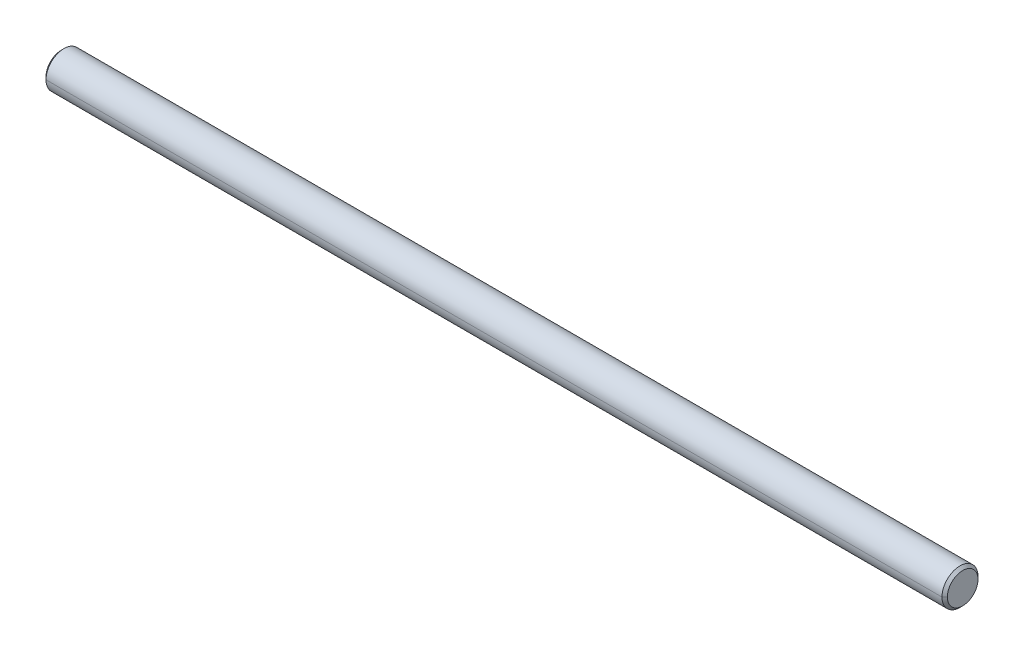
ISO-10303-21;
HEADER;
FILE_DESCRIPTION(('STEP AP214'),'2;1');
FILE_NAME('part.step','',(''),(''),'','','');
FILE_SCHEMA(('AUTOMOTIVE_DESIGN { 1 0 10303 214 1 1 1 1 }'));
ENDSEC;
DATA;
#1=APPLICATION_CONTEXT('core data for automotive mechanical design processes');
#2=APPLICATION_PROTOCOL_DEFINITION('international standard','automotive_design',2000,#1);
#3=PRODUCT_CONTEXT('',#1,'mechanical');
#4=PRODUCT('Part','Part','',(#3));
#5=PRODUCT_RELATED_PRODUCT_CATEGORY('part','',(#4));
#6=PRODUCT_DEFINITION_FORMATION('','',#4);
#7=PRODUCT_DEFINITION_CONTEXT('part definition',#1,'design');
#8=PRODUCT_DEFINITION('design','',#6,#7);
#9=PRODUCT_DEFINITION_SHAPE('','',#8);
#10=(LENGTH_UNIT() NAMED_UNIT(*) SI_UNIT(.MILLI.,.METRE.));
#11=(NAMED_UNIT(*) PLANE_ANGLE_UNIT() SI_UNIT($,.RADIAN.));
#12=(NAMED_UNIT(*) SI_UNIT($,.STERADIAN.) SOLID_ANGLE_UNIT());
#13=UNCERTAINTY_MEASURE_WITH_UNIT(LENGTH_MEASURE(1.E-05),#10,'distance_accuracy_value','');
#14=(GEOMETRIC_REPRESENTATION_CONTEXT(3) GLOBAL_UNCERTAINTY_ASSIGNED_CONTEXT((#13)) GLOBAL_UNIT_ASSIGNED_CONTEXT((#10,
#11,#12)) REPRESENTATION_CONTEXT('',''));
#15=CARTESIAN_POINT('',(0.,0.,0.));
#16=DIRECTION('',(0.,0.,1.));
#17=DIRECTION('',(1.,0.,0.));
#18=AXIS2_PLACEMENT_3D('',#15,#16,#17);
#19=CARTESIAN_POINT('',(248.5,0.,0.));
#20=DIRECTION('',(-1.,0.,0.));
#21=DIRECTION('',(0.,-1.,0.));
#22=AXIS2_PLACEMENT_3D('',#19,#20,#21);
#23=CONICAL_SURFACE('',#22,10.,0.7853981634);
#24=CARTESIAN_POINT('',(250.,0.,0.));
#25=DIRECTION('',(1.,0.,0.));
#26=DIRECTION('',(0.,0.,-1.));
#27=AXIS2_PLACEMENT_3D('',#24,#25,#26);
#28=CIRCLE('',#27,8.5);
#29=CARTESIAN_POINT('',(250.,0.,-8.5));
#30=VERTEX_POINT('',#29);
#31=CARTESIAN_POINT('',(249.999999999996,0.,8.49999999999617));
#32=VERTEX_POINT('',#31);
#33=EDGE_CURVE('E11',#30,#32,#28,.T.);
#34=ORIENTED_EDGE('',*,*,#33,.F.);
#35=DIRECTION('',(-0.707106781184734,0.,-0.707106781188361));
#36=VECTOR('',#35,1.);
#37=CARTESIAN_POINT('',(249.999999999996,0.,-8.49999999999617));
#38=LINE('',#37,#36);
#39=CARTESIAN_POINT('',(248.5,0.,-10.));
#40=VERTEX_POINT('',#39);
#41=EDGE_CURVE('E24',#30,#40,#38,.T.);
#42=ORIENTED_EDGE('',*,*,#41,.T.);
#43=CARTESIAN_POINT('',(248.5,0.,0.));
#44=DIRECTION('',(1.,0.,0.));
#45=DIRECTION('',(0.,0.,-1.));
#46=AXIS2_PLACEMENT_3D('',#43,#44,#45);
#47=CIRCLE('',#46,10.);
#48=CARTESIAN_POINT('',(248.5,0.,10.));
#49=VERTEX_POINT('',#48);
#50=EDGE_CURVE('E124',#40,#49,#47,.T.);
#51=ORIENTED_EDGE('',*,*,#50,.T.);
#52=DIRECTION('',(-0.707106781184734,0.,0.707106781188361));
#53=VECTOR('',#52,1.);
#54=CARTESIAN_POINT('',(249.999999999996,0.,8.49999999999617));
#55=LINE('',#54,#53);
#56=EDGE_CURVE('E119',#32,#49,#55,.T.);
#57=ORIENTED_EDGE('',*,*,#56,.F.);
#58=EDGE_LOOP('',(#34,#42,#51,#57));
#59=FACE_BOUND('',#58,.T.);
#60=ADVANCED_FACE('F16',(#59),#23,.T.);
#61=CARTESIAN_POINT('',(248.5,0.,0.));
#62=DIRECTION('',(-1.,0.,0.));
#63=DIRECTION('',(0.,1.,0.));
#64=AXIS2_PLACEMENT_3D('',#61,#62,#63);
#65=CONICAL_SURFACE('',#64,10.,0.7853981634);
#66=CARTESIAN_POINT('',(248.5,0.,0.));
#67=DIRECTION('',(1.,0.,0.));
#68=DIRECTION('',(0.,0.,-1.));
#69=AXIS2_PLACEMENT_3D('',#66,#67,#68);
#70=CIRCLE('',#69,10.);
#71=EDGE_CURVE('E115',#49,#40,#70,.T.);
#72=ORIENTED_EDGE('',*,*,#71,.T.);
#73=ORIENTED_EDGE('',*,*,#41,.F.);
#74=CARTESIAN_POINT('',(250.,0.,0.));
#75=DIRECTION('',(1.,0.,0.));
#76=DIRECTION('',(0.,0.,-1.));
#77=AXIS2_PLACEMENT_3D('',#74,#75,#76);
#78=CIRCLE('',#77,8.5);
#79=EDGE_CURVE('E110',#32,#30,#78,.T.);
#80=ORIENTED_EDGE('',*,*,#79,.F.);
#81=ORIENTED_EDGE('',*,*,#56,.T.);
#82=EDGE_LOOP('',(#72,#73,#80,#81));
#83=FACE_BOUND('',#82,.T.);
#84=ADVANCED_FACE('F138',(#83),#65,.T.);
#85=CARTESIAN_POINT('',(250.,8.5,0.));
#86=DIRECTION('',(-1.,0.,0.));
#87=DIRECTION('',(0.,0.,1.));
#88=AXIS2_PLACEMENT_3D('',#85,#86,#87);
#89=PLANE('',#88);
#90=ORIENTED_EDGE('',*,*,#33,.T.);
#91=ORIENTED_EDGE('',*,*,#79,.T.);
#92=EDGE_LOOP('',(#90,#91));
#93=FACE_BOUND('',#92,.T.);
#94=ADVANCED_FACE('F151',(#93),#89,.F.);
#95=CARTESIAN_POINT('',(-125.,0.,0.));
#96=DIRECTION('',(-1.,0.,0.));
#97=DIRECTION('',(0.,1.,0.));
#98=AXIS2_PLACEMENT_3D('',#95,#96,#97);
#99=CYLINDRICAL_SURFACE('',#98,10.);
#100=CARTESIAN_POINT('',(-248.5,0.,0.));
#101=DIRECTION('',(1.,0.,0.));
#102=DIRECTION('',(0.,0.,-1.));
#103=AXIS2_PLACEMENT_3D('',#100,#101,#102);
#104=CIRCLE('',#103,10.);
#105=CARTESIAN_POINT('',(-248.5,0.,10.));
#106=VERTEX_POINT('',#105);
#107=CARTESIAN_POINT('',(-248.5,0.,-10.));
#108=VERTEX_POINT('',#107);
#109=EDGE_CURVE('E73',#106,#108,#104,.T.);
#110=ORIENTED_EDGE('',*,*,#109,.T.);
#111=DIRECTION('',(-1.,0.,0.));
#112=VECTOR('',#111,1.);
#113=CARTESIAN_POINT('',(248.5,0.,-10.));
#114=LINE('',#113,#112);
#115=EDGE_CURVE('E101',#40,#108,#114,.T.);
#116=ORIENTED_EDGE('',*,*,#115,.F.);
#117=ORIENTED_EDGE('',*,*,#71,.F.);
#118=DIRECTION('',(-1.,0.,0.));
#119=VECTOR('',#118,1.);
#120=CARTESIAN_POINT('',(248.5,0.,10.));
#121=LINE('',#120,#119);
#122=EDGE_CURVE('E96',#49,#106,#121,.T.);
#123=ORIENTED_EDGE('',*,*,#122,.T.);
#124=EDGE_LOOP('',(#110,#116,#117,#123));
#125=FACE_BOUND('',#124,.T.);
#126=ADVANCED_FACE('F141',(#125),#99,.T.);
#127=CARTESIAN_POINT('',(-125.,0.,0.));
#128=DIRECTION('',(-1.,0.,0.));
#129=DIRECTION('',(0.,-1.,0.));
#130=AXIS2_PLACEMENT_3D('',#127,#128,#129);
#131=CYLINDRICAL_SURFACE('',#130,10.);
#132=ORIENTED_EDGE('',*,*,#50,.F.);
#133=ORIENTED_EDGE('',*,*,#115,.T.);
#134=CARTESIAN_POINT('',(-248.5,0.,0.));
#135=DIRECTION('',(1.,0.,0.));
#136=DIRECTION('',(0.,0.,-1.));
#137=AXIS2_PLACEMENT_3D('',#134,#135,#136);
#138=CIRCLE('',#137,10.);
#139=EDGE_CURVE('E91',#108,#106,#138,.T.);
#140=ORIENTED_EDGE('',*,*,#139,.T.);
#141=ORIENTED_EDGE('',*,*,#122,.F.);
#142=EDGE_LOOP('',(#132,#133,#140,#141));
#143=FACE_BOUND('',#142,.T.);
#144=ADVANCED_FACE('F142',(#143),#131,.T.);
#145=CARTESIAN_POINT('',(-250.,0.,0.));
#146=DIRECTION('',(1.,0.,0.));
#147=DIRECTION('',(0.,-1.,0.));
#148=AXIS2_PLACEMENT_3D('',#145,#146,#147);
#149=CONICAL_SURFACE('',#148,8.5,0.7853981634);
#150=ORIENTED_EDGE('',*,*,#139,.F.);
#151=DIRECTION('',(0.707106781184734,0.,-0.707106781188361));
#152=VECTOR('',#151,1.);
#153=CARTESIAN_POINT('',(-250.,0.,-8.5));
#154=LINE('',#153,#152);
#155=CARTESIAN_POINT('',(-250.,0.,-8.5));
#156=VERTEX_POINT('',#155);
#157=EDGE_CURVE('E64',#156,#108,#154,.T.);
#158=ORIENTED_EDGE('',*,*,#157,.F.);
#159=CARTESIAN_POINT('',(-250.,0.,0.));
#160=DIRECTION('',(1.,0.,0.));
#161=DIRECTION('',(0.,0.,-1.));
#162=AXIS2_PLACEMENT_3D('',#159,#160,#161);
#163=CIRCLE('',#162,8.5);
#164=CARTESIAN_POINT('',(-250.,0.,8.5));
#165=VERTEX_POINT('',#164);
#166=EDGE_CURVE('E57',#156,#165,#163,.T.);
#167=ORIENTED_EDGE('',*,*,#166,.T.);
#168=DIRECTION('',(0.707106781184734,0.,0.707106781188361));
#169=VECTOR('',#168,1.);
#170=CARTESIAN_POINT('',(-250.,0.,8.5));
#171=LINE('',#170,#169);
#172=EDGE_CURVE('E61',#165,#106,#171,.T.);
#173=ORIENTED_EDGE('',*,*,#172,.T.);
#174=EDGE_LOOP('',(#150,#158,#167,#173));
#175=FACE_BOUND('',#174,.T.);
#176=ADVANCED_FACE('F60',(#175),#149,.T.);
#177=CARTESIAN_POINT('',(-250.,0.,0.));
#178=DIRECTION('',(1.,0.,0.));
#179=DIRECTION('',(0.,1.,0.));
#180=AXIS2_PLACEMENT_3D('',#177,#178,#179);
#181=CONICAL_SURFACE('',#180,8.5,0.7853981634);
#182=CARTESIAN_POINT('',(-250.,0.,0.));
#183=DIRECTION('',(1.,0.,0.));
#184=DIRECTION('',(0.,0.,-1.));
#185=AXIS2_PLACEMENT_3D('',#182,#183,#184);
#186=CIRCLE('',#185,8.5);
#187=EDGE_CURVE('E72',#165,#156,#186,.T.);
#188=ORIENTED_EDGE('',*,*,#187,.T.);
#189=ORIENTED_EDGE('',*,*,#157,.T.);
#190=ORIENTED_EDGE('',*,*,#109,.F.);
#191=ORIENTED_EDGE('',*,*,#172,.F.);
#192=EDGE_LOOP('',(#188,#189,#190,#191));
#193=FACE_BOUND('',#192,.T.);
#194=ADVANCED_FACE('F71',(#193),#181,.T.);
#195=CARTESIAN_POINT('',(-250.,0.,0.));
#196=DIRECTION('',(1.,0.,0.));
#197=DIRECTION('',(0.,0.,-1.));
#198=AXIS2_PLACEMENT_3D('',#195,#196,#197);
#199=PLANE('',#198);
#200=ORIENTED_EDGE('',*,*,#166,.F.);
#201=ORIENTED_EDGE('',*,*,#187,.F.);
#202=EDGE_LOOP('',(#200,#201));
#203=FACE_BOUND('',#202,.T.);
#204=ADVANCED_FACE('F76',(#203),#199,.F.);
#205=CLOSED_SHELL('',(#60,#84,#94,#126,#144,#176,#194,#204));
#206=MANIFOLD_SOLID_BREP('B1',#205);
#207=ADVANCED_BREP_SHAPE_REPRESENTATION('',(#18,#206),#14);
#208=SHAPE_DEFINITION_REPRESENTATION(#9,#207);
ENDSEC;
END-ISO-10303-21;
